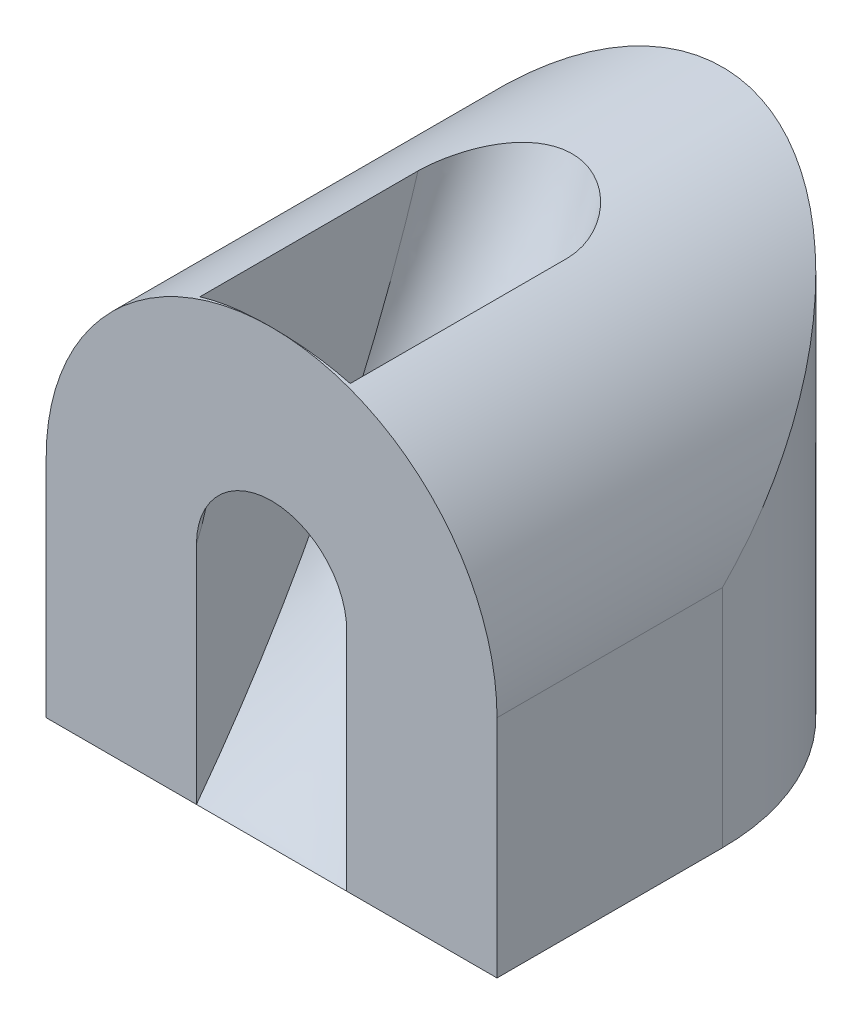
ISO-10303-21;
HEADER;
FILE_DESCRIPTION(('STEP AP214'),'2;1');
FILE_NAME('part.step','',(''),(''),'','','');
FILE_SCHEMA(('AUTOMOTIVE_DESIGN { 1 0 10303 214 1 1 1 1 }'));
ENDSEC;
DATA;
#1=APPLICATION_CONTEXT('core data for automotive mechanical design processes');
#2=APPLICATION_PROTOCOL_DEFINITION('international standard','automotive_design',2000,#1);
#3=PRODUCT_CONTEXT('',#1,'mechanical');
#4=PRODUCT('Part','Part','',(#3));
#5=PRODUCT_RELATED_PRODUCT_CATEGORY('part','',(#4));
#6=PRODUCT_DEFINITION_FORMATION('','',#4);
#7=PRODUCT_DEFINITION_CONTEXT('part definition',#1,'design');
#8=PRODUCT_DEFINITION('design','',#6,#7);
#9=PRODUCT_DEFINITION_SHAPE('','',#8);
#10=(LENGTH_UNIT() NAMED_UNIT(*) SI_UNIT(.MILLI.,.METRE.));
#11=(NAMED_UNIT(*) PLANE_ANGLE_UNIT() SI_UNIT($,.RADIAN.));
#12=(NAMED_UNIT(*) SI_UNIT($,.STERADIAN.) SOLID_ANGLE_UNIT());
#13=UNCERTAINTY_MEASURE_WITH_UNIT(LENGTH_MEASURE(1.E-05),#10,'distance_accuracy_value','');
#14=(GEOMETRIC_REPRESENTATION_CONTEXT(3) GLOBAL_UNCERTAINTY_ASSIGNED_CONTEXT((#13)) GLOBAL_UNIT_ASSIGNED_CONTEXT((#10,
#11,#12)) REPRESENTATION_CONTEXT('',''));
#15=CARTESIAN_POINT('',(0.,0.,0.));
#16=DIRECTION('',(0.,0.,1.));
#17=DIRECTION('',(1.,0.,0.));
#18=AXIS2_PLACEMENT_3D('',#15,#16,#17);
#19=CARTESIAN_POINT('',(0.,0.,60.));
#20=DIRECTION('',(0.,0.,-1.));
#21=DIRECTION('',(-1.,0.,0.));
#22=AXIS2_PLACEMENT_3D('',#19,#20,#21);
#23=PLANE('',#22);
#24=CARTESIAN_POINT('',(30.,30.,60.));
#25=DIRECTION('',(0.,0.,1.));
#26=DIRECTION('',(-1.,0.,0.));
#27=AXIS2_PLACEMENT_3D('',#24,#25,#26);
#28=CIRCLE('',#27,10.);
#29=CARTESIAN_POINT('',(40.,30.,60.));
#30=VERTEX_POINT('',#29);
#31=CARTESIAN_POINT('',(20.,30.,60.));
#32=VERTEX_POINT('',#31);
#33=EDGE_CURVE('E155',#30,#32,#28,.T.);
#34=ORIENTED_EDGE('',*,*,#33,.F.);
#35=DIRECTION('',(0.,1.,0.));
#36=VECTOR('',#35,1.);
#37=CARTESIAN_POINT('',(40.,0.,60.));
#38=LINE('',#37,#36);
#39=CARTESIAN_POINT('',(40.,0.,60.));
#40=VERTEX_POINT('',#39);
#41=EDGE_CURVE('E231',#40,#30,#38,.T.);
#42=ORIENTED_EDGE('',*,*,#41,.F.);
#43=DIRECTION('',(1.,0.,0.));
#44=VECTOR('',#43,1.);
#45=CARTESIAN_POINT('',(0.,0.,60.));
#46=LINE('',#45,#44);
#47=CARTESIAN_POINT('',(60.,0.,60.));
#48=VERTEX_POINT('',#47);
#49=EDGE_CURVE('E340',#40,#48,#46,.T.);
#50=ORIENTED_EDGE('',*,*,#49,.T.);
#51=DIRECTION('',(0.,1.,0.));
#52=VECTOR('',#51,1.);
#53=CARTESIAN_POINT('',(60.,0.,60.));
#54=LINE('',#53,#52);
#55=CARTESIAN_POINT('',(60.,30.,60.));
#56=VERTEX_POINT('',#55);
#57=EDGE_CURVE('E339',#48,#56,#54,.T.);
#58=ORIENTED_EDGE('',*,*,#57,.T.);
#59=CARTESIAN_POINT('',(30.,30.,60.));
#60=DIRECTION('',(0.,0.,1.));
#61=DIRECTION('',(1.,0.,0.));
#62=AXIS2_PLACEMENT_3D('',#59,#60,#61);
#63=CIRCLE('',#62,30.);
#64=CARTESIAN_POINT('',(30.000000000001,60.,60.));
#65=VERTEX_POINT('',#64);
#66=EDGE_CURVE('E279',#56,#65,#63,.T.);
#67=ORIENTED_EDGE('',*,*,#66,.T.);
#68=CARTESIAN_POINT('',(0.,30.,60.));
#69=VERTEX_POINT('',#68);
#70=EDGE_CURVE('E270',#65,#69,#63,.T.);
#71=ORIENTED_EDGE('',*,*,#70,.T.);
#72=DIRECTION('',(0.,-1.,0.));
#73=VECTOR('',#72,1.);
#74=CARTESIAN_POINT('',(0.,0.,60.));
#75=LINE('',#74,#73);
#76=CARTESIAN_POINT('',(0.,0.,60.));
#77=VERTEX_POINT('',#76);
#78=EDGE_CURVE('E343',#69,#77,#75,.T.);
#79=ORIENTED_EDGE('',*,*,#78,.T.);
#80=CARTESIAN_POINT('',(20.,0.,60.));
#81=VERTEX_POINT('',#80);
#82=EDGE_CURVE('E242',#77,#81,#46,.T.);
#83=ORIENTED_EDGE('',*,*,#82,.T.);
#84=DIRECTION('',(0.,-1.,0.));
#85=VECTOR('',#84,1.);
#86=CARTESIAN_POINT('',(20.,0.,60.));
#87=LINE('',#86,#85);
#88=EDGE_CURVE('E232',#32,#81,#87,.T.);
#89=ORIENTED_EDGE('',*,*,#88,.F.);
#90=EDGE_LOOP('',(#34,#42,#50,#58,#67,#71,#79,#83,#89));
#91=FACE_BOUND('',#90,.T.);
#92=ADVANCED_FACE('F151',(#91),#23,.F.);
#93=CARTESIAN_POINT('',(0.,0.,60.));
#94=DIRECTION('',(0.,1.,0.));
#95=DIRECTION('',(0.,0.,1.));
#96=AXIS2_PLACEMENT_3D('',#93,#94,#95);
#97=PLANE('',#96);
#98=DIRECTION('',(0.,0.,-1.));
#99=VECTOR('',#98,1.);
#100=CARTESIAN_POINT('',(60.,0.,60.));
#101=LINE('',#100,#99);
#102=CARTESIAN_POINT('',(60.,0.,30.));
#103=VERTEX_POINT('',#102);
#104=EDGE_CURVE('E347',#48,#103,#101,.T.);
#105=ORIENTED_EDGE('',*,*,#104,.F.);
#106=ORIENTED_EDGE('',*,*,#49,.F.);
#107=DIRECTION('',(1.,0.,0.));
#108=VECTOR('',#107,1.);
#109=CARTESIAN_POINT('',(40.,0.,60.));
#110=LINE('',#109,#108);
#111=EDGE_CURVE('E243',#81,#40,#110,.T.);
#112=ORIENTED_EDGE('',*,*,#111,.F.);
#113=ORIENTED_EDGE('',*,*,#82,.F.);
#114=DIRECTION('',(0.,0.,-1.));
#115=VECTOR('',#114,1.);
#116=CARTESIAN_POINT('',(0.,0.,60.));
#117=LINE('',#116,#115);
#118=CARTESIAN_POINT('',(0.,0.,30.));
#119=VERTEX_POINT('',#118);
#120=EDGE_CURVE('E350',#77,#119,#117,.T.);
#121=ORIENTED_EDGE('',*,*,#120,.T.);
#122=CARTESIAN_POINT('',(30.,0.,30.));
#123=DIRECTION('',(0.,1.,0.));
#124=DIRECTION('',(0.,0.,1.));
#125=AXIS2_PLACEMENT_3D('',#122,#123,#124);
#126=CIRCLE('',#125,30.);
#127=EDGE_CURVE('E263',#103,#119,#126,.T.);
#128=ORIENTED_EDGE('',*,*,#127,.F.);
#129=EDGE_LOOP('',(#105,#106,#112,#113,#121,#128));
#130=FACE_BOUND('',#129,.T.);
#131=ADVANCED_FACE('F369',(#130),#97,.F.);
#132=CARTESIAN_POINT('',(30.,30.,0.));
#133=DIRECTION('',(0.,0.,1.));
#134=DIRECTION('',(1.,0.,0.));
#135=AXIS2_PLACEMENT_3D('',#132,#133,#134);
#136=CYLINDRICAL_SURFACE('',#135,30.);
#137=CARTESIAN_POINT('',(20.,58.2842712474619,59.5404364997002));
#138=CARTESIAN_POINT('',(20.3764117266782,58.4173562522948,59.5670370780311));
#139=CARTESIAN_POINT('',(20.7554913170171,58.5429243230151,59.5934330018673));
#140=CARTESIAN_POINT('',(21.5184130634955,58.778847579892,59.6454398408068));
#141=CARTESIAN_POINT('',(21.902255274061,58.8892025920226,59.6710507469274));
#142=CARTESIAN_POINT('',(22.674367547863,59.0945833870843,59.7211272500816));
#143=CARTESIAN_POINT('',(23.0626402886108,59.1895993105405,59.7455921033556));
#144=CARTESIAN_POINT('',(23.8427397277054,59.3640592214653,59.7927096157521));
#145=CARTESIAN_POINT('',(24.2345664189615,59.4435032399949,59.8153622784894));
#146=CARTESIAN_POINT('',(25.4138586004392,59.6581347609159,59.8793468750788));
#147=CARTESIAN_POINT('',(26.2060241871201,59.7698579096076,59.9167663745096));
#148=CARTESIAN_POINT('',(27.3991120173108,59.889719144698,59.9588945201927));
#149=CARTESIAN_POINT('',(27.7975780938492,59.9217182345678,59.9706032899513));
#150=CARTESIAN_POINT('',(28.595630747783,59.9697757987336,59.9884471419536));
#151=CARTESIAN_POINT('',(28.9952173181561,59.9858343727112,59.9945822590515));
#152=CARTESIAN_POINT('',(29.7894041707114,60.0018550555771,60.000703989206));
#153=CARTESIAN_POINT('',(30.183999662026,60.0020295824545,60.0007717411792));
#154=CARTESIAN_POINT('',(30.9728434771183,59.9868169971521,59.9949568174823));
#155=CARTESIAN_POINT('',(31.3670918044353,59.9714300455079,59.9890742031976));
#156=CARTESIAN_POINT('',(32.1547274796549,59.9251206812359,59.9718552992318));
#157=CARTESIAN_POINT('',(32.5481143725186,59.8941914375081,59.9605166116073));
#158=CARTESIAN_POINT('',(33.3332120774773,59.8168628086714,59.9332447626323));
#159=CARTESIAN_POINT('',(33.724922812118,59.7704627163184,59.917311391242));
#160=CARTESIAN_POINT('',(34.6166469632445,59.6469645285372,59.8768353087296));
#161=CARTESIAN_POINT('',(35.1159267206711,59.5648945822954,59.851132284216));
#162=CARTESIAN_POINT('',(36.1095138498783,59.3756643224724,59.7958221496395));
#163=CARTESIAN_POINT('',(36.603820761685,59.2685017097465,59.7662146819361));
#164=CARTESIAN_POINT('',(37.5862170131717,59.029378422904,59.7046478779867));
#165=CARTESIAN_POINT('',(38.0743070567396,58.8974205832942,59.6726888108214));
#166=CARTESIAN_POINT('',(38.8008398701128,58.6811624823758,59.6237461865478));
#167=CARTESIAN_POINT('',(39.0420791748374,58.6060245149541,59.6072649682093));
#168=CARTESIAN_POINT('',(39.5225654819561,58.4496848292216,59.5740347873114));
#169=CARTESIAN_POINT('',(39.7618124902745,58.3684831289493,59.5572858255486));
#170=CARTESIAN_POINT('',(40.,58.2842712474619,59.5404364997002));
#171=B_SPLINE_CURVE_WITH_KNOTS('',3,(#137,#138,#139,#140,#141,#142,#143,#144,#145,#146,#147,
#148,#149,#150,#151,#152,#153,#154,#155,#156,#157,#158,#159,#160,#161,#162,#163,#164,#165,#166,
#167,#168,#169,#170),.UNSPECIFIED.,.F.,.F.,(4,2,2,2,2,2,2,2,2,2,2,2,2,2,2,2,4),(0.,
1.20030596656272,2.40062566258973,3.60171383995786,4.8027996215043,7.20221606405434,
8.40170622917079,9.60118889340434,10.7846284389643,11.9680557760268,13.1520037049294,
14.3360057649966,15.8552014428247,17.3745363732376,18.8936977239566,19.6532491499446,
20.4127983164844),.UNSPECIFIED.);
#172=CARTESIAN_POINT('',(40.,58.2842712474619,59.5404364997002));
#173=VERTEX_POINT('',#172);
#174=EDGE_CURVE('E13',#65,#173,#171,.T.);
#175=ORIENTED_EDGE('',*,*,#174,.F.);
#176=ORIENTED_EDGE('',*,*,#66,.F.);
#177=DIRECTION('',(0.,0.,1.));
#178=VECTOR('',#177,1.);
#179=CARTESIAN_POINT('',(60.,30.,0.));
#180=LINE('',#179,#178);
#181=CARTESIAN_POINT('',(60.,30.,30.));
#182=VERTEX_POINT('',#181);
#183=EDGE_CURVE('E268',#182,#56,#180,.T.);
#184=ORIENTED_EDGE('',*,*,#183,.F.);
#185=CARTESIAN_POINT('',(30.,30.,30.));
#186=DIRECTION('',(0.,0.707106781186547,0.707106781186547));
#187=DIRECTION('',(0.,-0.707106781186547,0.707106781186547));
#188=AXIS2_PLACEMENT_3D('',#185,#186,#187);
#189=ELLIPSE('',#188,42.4264068711928,30.);
#190=CARTESIAN_POINT('',(0.,30.,30.));
#191=VERTEX_POINT('',#190);
#192=EDGE_CURVE('E284',#191,#182,#189,.F.);
#193=ORIENTED_EDGE('',*,*,#192,.F.);
#194=DIRECTION('',(0.,0.,1.));
#195=VECTOR('',#194,1.);
#196=CARTESIAN_POINT('',(0.,30.,0.));
#197=LINE('',#196,#195);
#198=EDGE_CURVE('E273',#191,#69,#197,.T.);
#199=ORIENTED_EDGE('',*,*,#198,.T.);
#200=ORIENTED_EDGE('',*,*,#70,.F.);
#201=CARTESIAN_POINT('',(20.,58.28427124746,59.5404364996997));
#202=VERTEX_POINT('',#201);
#203=EDGE_CURVE('E283',#202,#65,#171,.T.);
#204=ORIENTED_EDGE('',*,*,#203,.F.);
#205=DIRECTION('',(0.,0.,1.));
#206=VECTOR('',#205,1.);
#207=CARTESIAN_POINT('',(20.,58.2842712474619,0.));
#208=LINE('',#207,#206);
#209=CARTESIAN_POINT('',(20.,58.2842712474619,30.5183879234737));
#210=VERTEX_POINT('',#209);
#211=EDGE_CURVE('E238',#210,#202,#208,.T.);
#212=ORIENTED_EDGE('',*,*,#211,.F.);
#213=CARTESIAN_POINT('',(40.,58.2842712474619,30.5183879218683));
#214=CARTESIAN_POINT('',(39.995955725067,58.2856974437746,30.3441326544386));
#215=CARTESIAN_POINT('',(39.9873425918076,58.2887457654241,30.1700427366629));
#216=CARTESIAN_POINT('',(39.9613024632968,58.2979272278874,29.8226402185775));
#217=CARTESIAN_POINT('',(39.9438773853844,58.3040596976381,29.6493274574433));
#218=CARTESIAN_POINT('',(39.8789233205975,58.3268255633563,29.1315830311112));
#219=CARTESIAN_POINT('',(39.818702658956,58.3478321919177,28.7888667686945));
#220=CARTESIAN_POINT('',(39.6669385442949,58.399941223203,28.1135128162289));
#221=CARTESIAN_POINT('',(39.5755890433293,58.430981052662,27.7808262813578));
#222=CARTESIAN_POINT('',(39.41628941269,58.4839708234815,27.2898050298247));
#223=CARTESIAN_POINT('',(39.3594617923253,58.5027106551405,27.1274306712541));
#224=CARTESIAN_POINT('',(39.2385622738871,58.5421269801491,26.8056421416579));
#225=CARTESIAN_POINT('',(39.1744905176644,58.5628034355755,26.6462279127399));
#226=CARTESIAN_POINT('',(38.9926603374193,58.6207348317234,26.2214037833533));
#227=CARTESIAN_POINT('',(38.8684232352315,58.6595640262028,25.9589525940494));
#228=CARTESIAN_POINT('',(38.6009909946985,58.7409548430918,25.444603485719));
#229=CARTESIAN_POINT('',(38.4577997933519,58.7835156897733,25.1927033893665));
#230=CARTESIAN_POINT('',(38.1528413046068,58.871376577274,24.7002080956112));
#231=CARTESIAN_POINT('',(37.9910385019177,58.9166817743186,24.4596357890768));
#232=CARTESIAN_POINT('',(37.6498875669924,59.0087999389554,23.9915510655278));
#233=CARTESIAN_POINT('',(37.4705374099796,59.0556130801292,23.7640401604766));
#234=CARTESIAN_POINT('',(37.0716165811358,59.1554366420284,23.2965758574041));
#235=CARTESIAN_POINT('',(36.8498114275306,59.2085021183273,23.0585256416594));
#236=CARTESIAN_POINT('',(36.5018720463272,59.287195525713,22.7168585741302));
#237=CARTESIAN_POINT('',(36.3833280880215,59.3132810524877,22.6055166027448));
#238=CARTESIAN_POINT('',(36.1412482444235,59.364951604042,22.3882578788418));
#239=CARTESIAN_POINT('',(36.0177124861875,59.3905366415361,22.282340988395));
#240=CARTESIAN_POINT('',(35.7659273791931,59.4409670920488,22.0764556710974));
#241=CARTESIAN_POINT('',(35.6376848019199,59.4658134811885,21.9764792018702));
#242=CARTESIAN_POINT('',(35.3764796922293,59.5145915741909,21.782642376462));
#243=CARTESIAN_POINT('',(35.2435170175942,59.5385232504479,21.6887822048085));
#244=CARTESIAN_POINT('',(34.9731351045528,59.5852453998663,21.5074999219322));
#245=CARTESIAN_POINT('',(34.8357171903254,59.6080362070834,21.4200759225753));
#246=CARTESIAN_POINT('',(34.5566035684191,59.6522735353211,21.2519881671803));
#247=CARTESIAN_POINT('',(34.4149081865102,59.6737201583333,21.1713238980825));
#248=CARTESIAN_POINT('',(34.1615432027514,59.7101637368791,21.0354183485213));
#249=CARTESIAN_POINT('',(34.0507194333979,59.7254843225566,20.9786837050317));
#250=CARTESIAN_POINT('',(33.826831650153,59.7551359577154,20.8695664142716));
#251=CARTESIAN_POINT('',(33.71376773886,59.769467052381,20.8171835682568));
#252=CARTESIAN_POINT('',(33.3714565659474,59.8108379760446,20.6667695514115));
#253=CARTESIAN_POINT('',(33.139019671165,59.8362656310511,20.5754351548203));
#254=CARTESIAN_POINT('',(32.6672323698886,59.8821355300431,20.4118261789888));
#255=CARTESIAN_POINT('',(32.4278865451547,59.902580996783,20.3395392763033));
#256=CARTESIAN_POINT('',(31.9435629529126,59.9379606893104,20.215207331399));
#257=CARTESIAN_POINT('',(31.698585109608,59.9528948408797,20.1631625617706));
#258=CARTESIAN_POINT('',(31.203848672099,59.9768630347924,20.0799220357429));
#259=CARTESIAN_POINT('',(30.9540752927829,59.9858741187238,20.0488073958908));
#260=CARTESIAN_POINT('',(30.4526183535698,59.9976337228918,20.0081870609587));
#261=CARTESIAN_POINT('',(30.2009347743094,60.0003821795603,19.9986815852197));
#262=CARTESIAN_POINT('',(29.697707652125,59.9995322090645,20.0016149031215));
#263=CARTESIAN_POINT('',(29.4461641097017,59.9959337593433,20.0140537747525));
#264=CARTESIAN_POINT('',(28.9452572035608,59.9824996530828,20.0604735958394));
#265=CARTESIAN_POINT('',(28.6958937435771,59.972664273373,20.0944535891809));
#266=CARTESIAN_POINT('',(28.2163141457756,59.9478310777492,20.1808092994176));
#267=CARTESIAN_POINT('',(27.9858547450417,59.9331829756473,20.2319427874608));
#268=CARTESIAN_POINT('',(27.5300466477471,59.8990228977796,20.3521208606647));
#269=CARTESIAN_POINT('',(27.3046977583164,59.879511105903,20.4211647686616));
#270=CARTESIAN_POINT('',(26.8602871019283,59.8360865074527,20.5760974504997));
#271=CARTESIAN_POINT('',(26.6412261718054,59.8121731182015,20.6619884546349));
#272=CARTESIAN_POINT('',(26.2105337684868,59.7604939704058,20.849743964762));
#273=CARTESIAN_POINT('',(25.9989026585834,59.7327280238124,20.9516092505127));
#274=CARTESIAN_POINT('',(25.5700007923944,59.6719587565633,21.1776206210928));
#275=CARTESIAN_POINT('',(25.3533101076915,59.6387286497639,21.3028052314117));
#276=CARTESIAN_POINT('',(24.9302015204303,59.5692932199031,21.5687144229308));
#277=CARTESIAN_POINT('',(24.7237839265132,59.5330878075392,21.7094394706144));
#278=CARTESIAN_POINT('',(24.3219677248768,59.4584746664858,22.0053894314617));
#279=CARTESIAN_POINT('',(24.1265719886255,59.4200663690981,22.1606180954535));
#280=CARTESIAN_POINT('',(23.7473752148907,59.3418162043777,22.4842985479974));
#281=CARTESIAN_POINT('',(23.5635749655607,59.3019742398861,22.6527512336528));
#282=CARTESIAN_POINT('',(23.1799501432469,59.2152598748043,23.0291190087708));
#283=CARTESIAN_POINT('',(22.9821503943007,59.1682670955236,23.2390742285352));
#284=CARTESIAN_POINT('',(22.6034029531975,59.074532697315,23.6737302484114));
#285=CARTESIAN_POINT('',(22.4224566686269,59.0277910996723,23.8984322774968));
#286=CARTESIAN_POINT('',(22.0776688653884,58.935592959149,24.3613099420817));
#287=CARTESIAN_POINT('',(21.9138506281857,58.8901382250713,24.5995032552064));
#288=CARTESIAN_POINT('',(21.6043082197779,58.8017061919957,25.0878551350484));
#289=CARTESIAN_POINT('',(21.4585845775784,58.7587289654489,25.3380140512908));
#290=CARTESIAN_POINT('',(21.2461146650845,58.6945260613526,25.736354878834));
#291=CARTESIAN_POINT('',(21.172859956065,58.672059717103,25.8809051588081));
#292=CARTESIAN_POINT('',(21.0323897030014,58.6284364439934,26.1730778629673));
#293=CARTESIAN_POINT('',(20.9651729664196,58.6072792568247,26.3206996733806));
#294=CARTESIAN_POINT('',(20.8369254981455,58.5664592925101,26.6188688483505));
#295=CARTESIAN_POINT('',(20.7758967225461,58.5467969884041,26.7694171201872));
#296=CARTESIAN_POINT('',(20.6602935215817,58.5091840070286,27.0731784311385));
#297=CARTESIAN_POINT('',(20.6057193447624,58.4912333956759,27.2263915726082));
#298=CARTESIAN_POINT('',(20.4522103751886,58.4403124615297,27.6888312823304));
#299=CARTESIAN_POINT('',(20.363121319812,58.4101544984763,28.0017112214524));
#300=CARTESIAN_POINT('',(20.2127328029859,58.3586974973924,28.6345931034634));
#301=CARTESIAN_POINT('',(20.1514143050617,58.3373923916344,28.954590009395));
#302=CARTESIAN_POINT('',(20.0750180817455,58.3106997978616,29.4824779918192));
#303=CARTESIAN_POINT('',(20.0512361245296,58.3023419071775,29.6889854351956));
#304=CARTESIAN_POINT('',(20.0161457359234,58.2899785457709,30.1030477888833));
#305=CARTESIAN_POINT('',(20.0048293102548,58.2859702856086,30.3106019420199));
#306=CARTESIAN_POINT('',(20.,58.2842712474619,30.5183879218683));
#307=B_SPLINE_CURVE_WITH_KNOTS('',3,(#213,#214,#215,#216,#217,#218,#219,#220,#221,#222,#223,
#224,#225,#226,#227,#228,#229,#230,#231,#232,#233,#234,#235,#236,#237,#238,#239,#240,#241,#242,
#243,#244,#245,#246,#247,#248,#249,#250,#251,#252,#253,#254,#255,#256,#257,#258,#259,#260,#261,
#262,#263,#264,#265,#266,#267,#268,#269,#270,#271,#272,#273,#274,#275,#276,#277,#278,#279,#280,
#281,#282,#283,#284,#285,#286,#287,#288,#289,#290,#291,#292,#293,#294,#295,#296,#297,#298,#299,
#300,#301,#302,#303,#304,#305,#306),.UNSPECIFIED.,.F.,.F.,(4,2,2,2,2,2,2,2,2,2,2,2,2,2,2,2,2,2,
2,2,2,2,2,2,2,2,2,2,2,2,2,2,2,2,2,2,2,2,2,2,2,2,2,2,2,2,4),(0.,0.522775102345921,
1.04543650604589,2.08933061267486,3.12683605344404,3.64582062567247,4.16479503717985,
5.04276378658663,5.92055045645502,6.80004084096993,7.67963282921351,8.66724463416843,
9.16125070840551,9.65524421662093,10.1485529387342,10.6418765369803,11.1350548308712,
11.6281956588339,12.004421564084,12.3806302778432,13.1328073567238,13.8844965866446,
14.6361959388276,15.3907920365548,16.1453957936791,16.9000022326651,17.6545751803761,
18.3633318304973,19.0720616875863,19.780885432918,20.4897437891245,21.2463418426302,
22.0029626134036,22.7597796008454,23.5166479743777,24.3925287688938,25.2684826507184,
26.1456121120425,27.022767210706,27.5134495532756,28.0040347689213,28.4947745844276,
28.985533290589,29.9642510339454,30.9422968555739,31.5660263352638,32.1893555772902),.UNSPECIFIED.);
#308=CARTESIAN_POINT('',(40.,58.2842712422307,30.5183879234737));
#309=VERTEX_POINT('',#308);
#310=EDGE_CURVE('E286',#309,#210,#307,.T.);
#311=ORIENTED_EDGE('',*,*,#310,.F.);
#312=DIRECTION('',(0.,0.,1.));
#313=VECTOR('',#312,1.);
#314=CARTESIAN_POINT('',(40.0000000000001,58.2842712474619,0.));
#315=LINE('',#314,#313);
#316=EDGE_CURVE('E161',#173,#309,#315,.F.);
#317=ORIENTED_EDGE('',*,*,#316,.F.);
#318=EDGE_LOOP('',(#175,#176,#184,#193,#199,#200,#204,#212,#311,#317));
#319=FACE_BOUND('',#318,.T.);
#320=ADVANCED_FACE('F295',(#319),#136,.T.);
#321=CARTESIAN_POINT('',(0.,0.,60.));
#322=DIRECTION('',(1.,0.,0.));
#323=DIRECTION('',(0.,0.,-1.));
#324=AXIS2_PLACEMENT_3D('',#321,#322,#323);
#325=PLANE('',#324);
#326=DIRECTION('',(0.,-1.,0.));
#327=VECTOR('',#326,1.);
#328=CARTESIAN_POINT('',(0.,60.,30.));
#329=LINE('',#328,#327);
#330=EDGE_CURVE('E265',#191,#119,#329,.T.);
#331=ORIENTED_EDGE('',*,*,#330,.T.);
#332=ORIENTED_EDGE('',*,*,#120,.F.);
#333=ORIENTED_EDGE('',*,*,#78,.F.);
#334=ORIENTED_EDGE('',*,*,#198,.F.);
#335=EDGE_LOOP('',(#331,#332,#333,#334));
#336=FACE_BOUND('',#335,.T.);
#337=ADVANCED_FACE('F153',(#336),#325,.F.);
#338=CARTESIAN_POINT('',(60.,0.,60.));
#339=DIRECTION('',(-1.,0.,0.));
#340=DIRECTION('',(0.,0.,1.));
#341=AXIS2_PLACEMENT_3D('',#338,#339,#340);
#342=PLANE('',#341);
#343=ORIENTED_EDGE('',*,*,#104,.T.);
#344=DIRECTION('',(0.,-1.,0.));
#345=VECTOR('',#344,1.);
#346=CARTESIAN_POINT('',(60.,60.,30.));
#347=LINE('',#346,#345);
#348=EDGE_CURVE('E260',#182,#103,#347,.T.);
#349=ORIENTED_EDGE('',*,*,#348,.F.);
#350=ORIENTED_EDGE('',*,*,#183,.T.);
#351=ORIENTED_EDGE('',*,*,#57,.F.);
#352=EDGE_LOOP('',(#343,#349,#350,#351));
#353=FACE_BOUND('',#352,.T.);
#354=ADVANCED_FACE('F360',(#353),#342,.F.);
#355=CARTESIAN_POINT('',(30.,60.,30.));
#356=DIRECTION('',(0.,-1.,0.));
#357=DIRECTION('',(0.,0.,-1.));
#358=AXIS2_PLACEMENT_3D('',#355,#356,#357);
#359=CYLINDRICAL_SURFACE('',#358,30.);
#360=ORIENTED_EDGE('',*,*,#192,.T.);
#361=ORIENTED_EDGE('',*,*,#348,.T.);
#362=ORIENTED_EDGE('',*,*,#127,.T.);
#363=ORIENTED_EDGE('',*,*,#330,.F.);
#364=EDGE_LOOP('',(#360,#361,#362,#363));
#365=FACE_BOUND('',#364,.T.);
#366=ADVANCED_FACE('F317',(#365),#359,.T.);
#367=CARTESIAN_POINT('',(40.,0.,60.));
#368=CARTESIAN_POINT('',(40.,17.8058533066775,46.600764862011));
#369=CARTESIAN_POINT('',(40.,37.8058533066775,36.600764862011));
#370=CARTESIAN_POINT('',(40.,60.,30.));
#371=CARTESIAN_POINT('',(39.0001721237353,0.,60.));
#372=CARTESIAN_POINT('',(39.3334480824902,17.8058533066775,46.2199307324675));
#373=CARTESIAN_POINT('',(39.6667240412451,37.8058533066775,35.839096602924));
#374=CARTESIAN_POINT('',(40.,60.,28.8574976113694));
#375=CARTESIAN_POINT('',(37.6657378848733,0.,60.));
#376=CARTESIAN_POINT('',(38.3444305213209,17.8058533066775,45.6145393066009));
#377=CARTESIAN_POINT('',(39.0231231577684,37.8058533066775,34.6283137511908));
#378=CARTESIAN_POINT('',(39.7018157942159,60.,27.0413233337696));
#379=CARTESIAN_POINT('',(36.0038116306767,0.,60.));
#380=CARTESIAN_POINT('',(36.8555797462886,17.8058533066775,44.8352342686712));
#381=CARTESIAN_POINT('',(37.7073478619005,37.8058533066776,33.0697036753314));
#382=CARTESIAN_POINT('',(38.5591159775124,60.0000000000001,24.7034082199805));
#383=CARTESIAN_POINT('',(34.7968735309418,0.,60.));
#384=CARTESIAN_POINT('',(35.6424536355244,17.8058533066774,44.3007753373696));
#385=CARTESIAN_POINT('',(36.4880337401071,37.8058533066774,32.0007858127281));
#386=CARTESIAN_POINT('',(37.3336138446897,59.9999999999999,23.1000314260757));
#387=CARTESIAN_POINT('',(33.6102889142221,0.,60.));
#388=CARTESIAN_POINT('',(34.3311362470794,17.8058533066775,43.8497855536846));
#389=CARTESIAN_POINT('',(35.0519835799366,37.8058533066776,31.0988062453581));
#390=CARTESIAN_POINT('',(35.7728309127939,60.0000000000001,21.7470620750206));
#391=CARTESIAN_POINT('',(32.4278803129987,0.,60.));
#392=CARTESIAN_POINT('',(32.9371307526973,17.8058533066775,43.5134751173084));
#393=CARTESIAN_POINT('',(33.4463811923959,37.8058533066774,30.4261853726058));
#394=CARTESIAN_POINT('',(33.9556316320945,59.9999999999999,20.7381307658922));
#395=CARTESIAN_POINT('',(31.2334702597525,0.,60.));
#396=CARTESIAN_POINT('',(31.484946118997,17.8058533066775,43.3105057090854));
#397=CARTESIAN_POINT('',(31.7364219782415,37.8058533066775,30.0202465561598));
#398=CARTESIAN_POINT('',(31.9878978374859,60.,20.1292225412231));
#399=CARTESIAN_POINT('',(30.4166666666667,0.,60.));
#400=CARTESIAN_POINT('',(30.4959439328575,17.8058533066775,43.2674315286777));
#401=CARTESIAN_POINT('',(30.5752211990484,37.8058533066775,29.9340981953444));
#402=CARTESIAN_POINT('',(30.6544984652393,60.,20.));
#403=CARTESIAN_POINT('',(29.5833333333333,0.,60.));
#404=CARTESIAN_POINT('',(29.5040560671425,17.8058533066775,43.2674315286777));
#405=CARTESIAN_POINT('',(29.4247788009516,37.8058533066775,29.9340981953444));
#406=CARTESIAN_POINT('',(29.3455015347607,60.,20.));
#407=CARTESIAN_POINT('',(28.7665297402475,0.,60.));
#408=CARTESIAN_POINT('',(28.515053881003,17.8058533066775,43.3105057090854));
#409=CARTESIAN_POINT('',(28.2635780217585,37.8058533066775,30.0202465561598));
#410=CARTESIAN_POINT('',(28.012102162514,60.,20.1292225412231));
#411=CARTESIAN_POINT('',(27.5721196870013,0.,60.));
#412=CARTESIAN_POINT('',(27.0628692473027,17.8058533066775,43.5134751173084));
#413=CARTESIAN_POINT('',(26.5536188076042,37.8058533066774,30.4261853726058));
#414=CARTESIAN_POINT('',(26.0443683679056,59.9999999999999,20.7381307658922));
#415=CARTESIAN_POINT('',(26.3897110857779,0.,60.));
#416=CARTESIAN_POINT('',(25.6688637529206,17.8058533066775,43.8497855536846));
#417=CARTESIAN_POINT('',(24.9480164200633,37.8058533066776,31.0988062453581));
#418=CARTESIAN_POINT('',(24.227169087206,60.0000000000001,21.7470620750206));
#419=CARTESIAN_POINT('',(25.2031264690582,0.,60.));
#420=CARTESIAN_POINT('',(24.3575463644756,17.8058533066774,44.3007753373696));
#421=CARTESIAN_POINT('',(23.5119662598929,37.8058533066774,32.0007858127282));
#422=CARTESIAN_POINT('',(22.6663861553102,59.9999999999998,23.1000314260757));
#423=CARTESIAN_POINT('',(23.9961883693233,0.,60.));
#424=CARTESIAN_POINT('',(23.1444202537114,17.8058533066775,44.8352342686712));
#425=CARTESIAN_POINT('',(22.2926521380995,37.8058533066776,33.0697036753314));
#426=CARTESIAN_POINT('',(21.4408840224876,60.0000000000001,24.7034082199804));
#427=CARTESIAN_POINT('',(22.3342621151267,0.,60.));
#428=CARTESIAN_POINT('',(21.6555694786791,17.8058533066774,45.6145393066009));
#429=CARTESIAN_POINT('',(20.9768768422316,37.8058533066774,34.6283137511908));
#430=CARTESIAN_POINT('',(20.2981842057841,59.9999999999998,27.0413233337696));
#431=CARTESIAN_POINT('',(20.9998278762647,0.,60.));
#432=CARTESIAN_POINT('',(20.6665519175098,17.8058533066775,46.2199307324675));
#433=CARTESIAN_POINT('',(20.3332759587549,37.8058533066775,35.839096602924));
#434=CARTESIAN_POINT('',(20.,60.,28.8574976113694));
#435=CARTESIAN_POINT('',(20.,0.,60.));
#436=CARTESIAN_POINT('',(20.,17.8058533066775,46.600764862011));
#437=CARTESIAN_POINT('',(20.,37.8058533066775,36.600764862011));
#438=CARTESIAN_POINT('',(20.,60.,30.));
#439=B_SPLINE_SURFACE_WITH_KNOTS('',3,3,((#367,#368,#369,#370),(#371,#372,#373,#374),(#375,#376,
#377,#378),(#379,#380,#381,#382),(#383,#384,#385,#386),(#387,#388,#389,#390),(#391,#392,#393,
#394),(#395,#396,#397,#398),(#399,#400,#401,#402),(#403,#404,#405,#406),(#407,#408,#409,#410),
(#411,#412,#413,#414),(#415,#416,#417,#418),(#419,#420,#421,#422),(#423,#424,#425,#426),(#427,
#428,#429,#430),(#431,#432,#433,#434),(#435,#436,#437,#438)),.UNSPECIFIED.,.F.,.F.,.F.,(4,1,1,1,
1,1,1,2,1,1,1,1,1,1,4),(4,4),(0.7692613249537,0.798103659334488,0.812524826524881,
0.826945993715275,0.841367160905669,0.855788328096063,0.870209495286456,0.88463066247685,
0.899051829667244,0.913472996857638,0.927894164048031,0.942315331238425,0.956736498428819,
0.971157665619212,1.),(0.,1.),.UNSPECIFIED.);
#440=CARTESIAN_POINT('',(40.,0.,60.));
#441=CARTESIAN_POINT('',(40.,17.8058533066775,46.600764862011));
#442=CARTESIAN_POINT('',(40.,37.8058533066775,36.600764862011));
#443=CARTESIAN_POINT('',(40.,60.,30.));
#444=B_SPLINE_CURVE_WITH_KNOTS('',3,(#440,#441,#442,#443),.UNSPECIFIED.,.F.,.F.,(4,4),(0.,1.),.UNSPECIFIED.);
#445=EDGE_CURVE('E455',#40,#309,#444,.T.);
#446=CARTESIAN_POINT('',(20.,0.,60.));
#447=CARTESIAN_POINT('',(20.,17.8058533066775,46.600764862011));
#448=CARTESIAN_POINT('',(20.,37.8058533066775,36.600764862011));
#449=CARTESIAN_POINT('',(20.,60.,30.));
#450=B_SPLINE_CURVE_WITH_KNOTS('',3,(#446,#447,#448,#449),.UNSPECIFIED.,.F.,.F.,(4,4),(0.,1.),.UNSPECIFIED.);
#451=EDGE_CURVE('E169',#81,#210,#450,.T.);
#452=ORIENTED_EDGE('',*,*,#445,.T.);
#453=ORIENTED_EDGE('',*,*,#310,.T.);
#454=ORIENTED_EDGE('',*,*,#451,.F.);
#455=ORIENTED_EDGE('',*,*,#111,.T.);
#456=EDGE_LOOP('',(#452,#453,#454,#455));
#457=FACE_BOUND('',#456,.T.);
#458=ADVANCED_FACE('F305',(#457),#439,.F.);
#459=CARTESIAN_POINT('',(40.,30.,60.));
#460=DIRECTION('',(1.,0.,0.));
#461=DIRECTION('',(0.,-1.,0.));
#462=AXIS2_PLACEMENT_3D('',#459,#460,#461);
#463=PLANE('',#462);
#464=ORIENTED_EDGE('',*,*,#316,.T.);
#465=ORIENTED_EDGE('',*,*,#445,.F.);
#466=ORIENTED_EDGE('',*,*,#41,.T.);
#467=CARTESIAN_POINT('',(40.,30.,60.));
#468=CARTESIAN_POINT('',(40.,37.8058533066775,56.600764862011));
#469=CARTESIAN_POINT('',(40.,47.8058533066775,56.600764862011));
#470=CARTESIAN_POINT('',(40.,60.,60.));
#471=B_SPLINE_CURVE_WITH_KNOTS('',3,(#467,#468,#469,#470),.UNSPECIFIED.,.F.,.F.,(4,4),(0.,1.),.UNSPECIFIED.);
#472=EDGE_CURVE('E226',#30,#173,#471,.T.);
#473=ORIENTED_EDGE('',*,*,#472,.T.);
#474=EDGE_LOOP('',(#464,#465,#466,#473));
#475=FACE_BOUND('',#474,.T.);
#476=ADVANCED_FACE('F304',(#475),#463,.F.);
#477=CARTESIAN_POINT('',(20.,30.,60.));
#478=CARTESIAN_POINT('',(20.,37.8058533066775,56.600764862011));
#479=CARTESIAN_POINT('',(20.,47.8058533066775,56.600764862011));
#480=CARTESIAN_POINT('',(20.,60.,60.));
#481=CARTESIAN_POINT('',(20.,31.3089969285501,60.));
#482=CARTESIAN_POINT('',(20.2777777777778,38.6785179257109,56.600764862011));
#483=CARTESIAN_POINT('',(20.5555555555555,48.2421856161942,56.600764862011));
#484=CARTESIAN_POINT('',(20.8333333333333,60.,60.));
#485=CARTESIAN_POINT('',(20.5200489578287,33.9265171292208,60.));
#486=CARTESIAN_POINT('',(21.1800326385525,40.4235313928247,56.6007648620111));
#487=CARTESIAN_POINT('',(21.8400163192762,49.1146923497511,56.600764862011));
#488=CARTESIAN_POINT('',(22.5,60.,60.));
#489=CARTESIAN_POINT('',(22.7447566827606,37.2554529144819,60.));
#490=CARTESIAN_POINT('',(23.4965044551738,42.6428219163321,56.6007648620111));
#491=CARTESIAN_POINT('',(24.2482522275869,50.2243376115048,56.6007648620111));
#492=CARTESIAN_POINT('',(25.,60.,60.));
#493=CARTESIAN_POINT('',(26.0733499834318,39.4796260779066,59.9999999999999));
#494=CARTESIAN_POINT('',(26.5488999889545,44.1256040252819,56.600764862011));
#495=CARTESIAN_POINT('',(27.0244499944773,50.9657286659797,56.600764862011));
#496=CARTESIAN_POINT('',(27.5,60.,60.));
#497=CARTESIAN_POINT('',(30.,40.2607067298664,60.0000000000001));
#498=CARTESIAN_POINT('',(30.,44.6463244599218,56.6007648620111));
#499=CARTESIAN_POINT('',(30.,51.2260888832996,56.6007648620111));
#500=CARTESIAN_POINT('',(30.,60.,60.));
#501=CARTESIAN_POINT('',(33.9266500165681,39.4796260779066,60.));
#502=CARTESIAN_POINT('',(33.4511000110454,44.1256040252819,56.600764862011));
#503=CARTESIAN_POINT('',(32.9755500055227,50.9657286659797,56.600764862011));
#504=CARTESIAN_POINT('',(32.5,60.,60.));
#505=CARTESIAN_POINT('',(37.2552433172393,37.2554529144819,60.));
#506=CARTESIAN_POINT('',(36.5034955448262,42.6428219163321,56.600764862011));
#507=CARTESIAN_POINT('',(35.7517477724131,50.2243376115048,56.600764862011));
#508=CARTESIAN_POINT('',(35.,60.,60.));
#509=CARTESIAN_POINT('',(39.4799510421713,33.9265171292208,60.));
#510=CARTESIAN_POINT('',(38.8199673614476,40.4235313928247,56.6007648620111));
#511=CARTESIAN_POINT('',(38.1599836807238,49.1146923497511,56.600764862011));
#512=CARTESIAN_POINT('',(37.5,60.,60.));
#513=CARTESIAN_POINT('',(40.,31.3089969285501,60.));
#514=CARTESIAN_POINT('',(39.7222222222222,38.6785179257109,56.600764862011));
#515=CARTESIAN_POINT('',(39.4444444444444,48.2421856161942,56.600764862011));
#516=CARTESIAN_POINT('',(39.1666666666667,60.,60.));
#517=CARTESIAN_POINT('',(40.,30.,60.));
#518=CARTESIAN_POINT('',(40.,37.8058533066775,56.600764862011));
#519=CARTESIAN_POINT('',(40.,47.8058533066775,56.600764862011));
#520=CARTESIAN_POINT('',(40.,60.,60.));
#521=B_SPLINE_SURFACE_WITH_KNOTS('',3,3,((#477,#478,#479,#480),(#481,#482,#483,#484),(#485,#486,
#487,#488),(#489,#490,#491,#492),(#493,#494,#495,#496),(#497,#498,#499,#500),(#501,#502,#503,
#504),(#505,#506,#507,#508),(#509,#510,#511,#512),(#513,#514,#515,#516),(#517,#518,#519,#520)),
.UNSPECIFIED.,.F.,.F.,.F.,(4,1,1,1,1,1,1,1,4),(4,4),(0.2692613249537,0.298103659334488,
0.326945993715275,0.355788328096063,0.38463066247685,0.413472996857638,0.442315331238425,
0.471157665619212,0.5),(0.,1.),.UNSPECIFIED.);
#522=CARTESIAN_POINT('',(20.,30.,60.));
#523=CARTESIAN_POINT('',(20.,37.8058533066775,56.600764862011));
#524=CARTESIAN_POINT('',(20.,47.8058533066775,56.600764862011));
#525=CARTESIAN_POINT('',(20.,60.,60.));
#526=B_SPLINE_CURVE_WITH_KNOTS('',3,(#522,#523,#524,#525),.UNSPECIFIED.,.F.,.F.,(4,4),(0.,1.),.UNSPECIFIED.);
#527=EDGE_CURVE('E223',#32,#202,#526,.T.);
#528=ORIENTED_EDGE('',*,*,#203,.T.);
#529=ORIENTED_EDGE('',*,*,#174,.T.);
#530=ORIENTED_EDGE('',*,*,#472,.F.);
#531=ORIENTED_EDGE('',*,*,#33,.T.);
#532=ORIENTED_EDGE('',*,*,#527,.T.);
#533=EDGE_LOOP('',(#528,#529,#530,#531,#532));
#534=FACE_BOUND('',#533,.T.);
#535=ADVANCED_FACE('F222',(#534),#521,.F.);
#536=CARTESIAN_POINT('',(20.,0.,60.));
#537=DIRECTION('',(-1.,0.,0.));
#538=DIRECTION('',(0.,1.,0.));
#539=AXIS2_PLACEMENT_3D('',#536,#537,#538);
#540=PLANE('',#539);
#541=ORIENTED_EDGE('',*,*,#211,.T.);
#542=ORIENTED_EDGE('',*,*,#527,.F.);
#543=ORIENTED_EDGE('',*,*,#88,.T.);
#544=ORIENTED_EDGE('',*,*,#451,.T.);
#545=EDGE_LOOP('',(#541,#542,#543,#544));
#546=FACE_BOUND('',#545,.T.);
#547=ADVANCED_FACE('F235',(#546),#540,.F.);
#548=CLOSED_SHELL('',(#92,#131,#320,#337,#354,#366,#458,#476,#535,#547));
#549=MANIFOLD_SOLID_BREP('B2',#548);
#550=ADVANCED_BREP_SHAPE_REPRESENTATION('',(#18,#549),#14);
#551=SHAPE_DEFINITION_REPRESENTATION(#9,#550);
ENDSEC;
END-ISO-10303-21;
